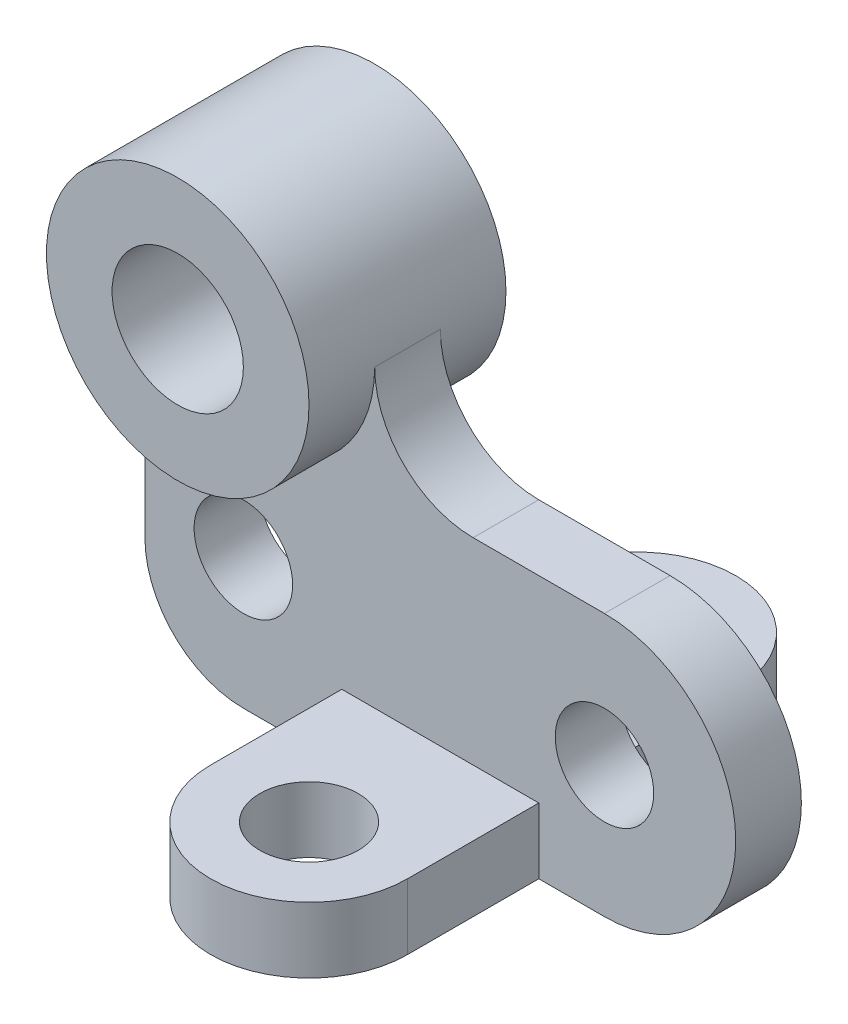
ISO-10303-21;
HEADER;
FILE_DESCRIPTION(('STEP AP214'),'2;1');
FILE_NAME('part.step','',(''),(''),'','','');
FILE_SCHEMA(('AUTOMOTIVE_DESIGN { 1 0 10303 214 1 1 1 1 }'));
ENDSEC;
DATA;
#1=APPLICATION_CONTEXT('core data for automotive mechanical design processes');
#2=APPLICATION_PROTOCOL_DEFINITION('international standard','automotive_design',2000,#1);
#3=PRODUCT_CONTEXT('',#1,'mechanical');
#4=PRODUCT('Part','Part','',(#3));
#5=PRODUCT_RELATED_PRODUCT_CATEGORY('part','',(#4));
#6=PRODUCT_DEFINITION_FORMATION('','',#4);
#7=PRODUCT_DEFINITION_CONTEXT('part definition',#1,'design');
#8=PRODUCT_DEFINITION('design','',#6,#7);
#9=PRODUCT_DEFINITION_SHAPE('','',#8);
#10=(LENGTH_UNIT() NAMED_UNIT(*) SI_UNIT(.MILLI.,.METRE.));
#11=(NAMED_UNIT(*) PLANE_ANGLE_UNIT() SI_UNIT($,.RADIAN.));
#12=(NAMED_UNIT(*) SI_UNIT($,.STERADIAN.) SOLID_ANGLE_UNIT());
#13=UNCERTAINTY_MEASURE_WITH_UNIT(LENGTH_MEASURE(1.E-05),#10,'distance_accuracy_value','');
#14=(GEOMETRIC_REPRESENTATION_CONTEXT(3) GLOBAL_UNCERTAINTY_ASSIGNED_CONTEXT((#13)) GLOBAL_UNIT_ASSIGNED_CONTEXT((#10,
#11,#12)) REPRESENTATION_CONTEXT('',''));
#15=CARTESIAN_POINT('',(0.,0.,0.));
#16=DIRECTION('',(0.,0.,1.));
#17=DIRECTION('',(1.,0.,0.));
#18=AXIS2_PLACEMENT_3D('',#15,#16,#17);
#19=CARTESIAN_POINT('',(-19.05,0.,6.35));
#20=DIRECTION('',(1.,0.,0.));
#21=DIRECTION('',(0.,1.,0.));
#22=AXIS2_PLACEMENT_3D('',#19,#20,#21);
#23=PLANE('',#22);
#24=DIRECTION('',(0.,-1.,0.));
#25=VECTOR('',#24,1.);
#26=CARTESIAN_POINT('',(-19.05,0.,-6.35));
#27=LINE('',#26,#25);
#28=CARTESIAN_POINT('',(-19.05,-16.8005208252601,-6.35));
#29=VERTEX_POINT('',#28);
#30=CARTESIAN_POINT('',(-19.05,-50.7999999999999,-6.35));
#31=VERTEX_POINT('',#30);
#32=EDGE_CURVE('E283',#29,#31,#27,.T.);
#33=ORIENTED_EDGE('',*,*,#32,.T.);
#34=DIRECTION('',(0.,0.,-1.));
#35=VECTOR('',#34,1.);
#36=CARTESIAN_POINT('',(-19.05,-50.7999999999999,6.35));
#37=LINE('',#36,#35);
#38=CARTESIAN_POINT('',(-19.05,-50.7999999999999,6.35));
#39=VERTEX_POINT('',#38);
#40=EDGE_CURVE('E330',#39,#31,#37,.T.);
#41=ORIENTED_EDGE('',*,*,#40,.F.);
#42=DIRECTION('',(0.,-1.,0.));
#43=VECTOR('',#42,1.);
#44=CARTESIAN_POINT('',(-19.05,0.,6.35));
#45=LINE('',#44,#43);
#46=CARTESIAN_POINT('',(-19.05,-16.8005208252601,6.35));
#47=VERTEX_POINT('',#46);
#48=EDGE_CURVE('E249',#47,#39,#45,.T.);
#49=ORIENTED_EDGE('',*,*,#48,.F.);
#50=DIRECTION('',(0.,0.,-1.));
#51=VECTOR('',#50,1.);
#52=CARTESIAN_POINT('',(-19.05,-16.8005208252601,6.35));
#53=LINE('',#52,#51);
#54=EDGE_CURVE('E275',#47,#29,#53,.T.);
#55=ORIENTED_EDGE('',*,*,#54,.T.);
#56=EDGE_LOOP('',(#33,#41,#49,#55));
#57=FACE_BOUND('',#56,.T.);
#58=ADVANCED_FACE('F41',(#57),#23,.F.);
#59=CARTESIAN_POINT('',(0.,-50.8,6.35));
#60=DIRECTION('',(0.,0.,-1.));
#61=DIRECTION('',(-1.,0.,0.));
#62=AXIS2_PLACEMENT_3D('',#59,#60,#61);
#63=CYLINDRICAL_SURFACE('',#62,19.05);
#64=CARTESIAN_POINT('',(0.,-50.8,-6.35));
#65=DIRECTION('',(0.,0.,1.));
#66=DIRECTION('',(1.,0.,0.));
#67=AXIS2_PLACEMENT_3D('',#64,#65,#66);
#68=CIRCLE('',#67,19.05);
#69=CARTESIAN_POINT('',(1.35308431126191E-13,-69.85,-6.35));
#70=VERTEX_POINT('',#69);
#71=EDGE_CURVE('E287',#31,#70,#68,.T.);
#72=ORIENTED_EDGE('',*,*,#71,.T.);
#73=DIRECTION('',(0.,0.,-1.));
#74=VECTOR('',#73,1.);
#75=CARTESIAN_POINT('',(1.35308431126191E-13,-69.85,6.35));
#76=LINE('',#75,#74);
#77=CARTESIAN_POINT('',(1.35308431126191E-13,-69.85,6.35));
#78=VERTEX_POINT('',#77);
#79=EDGE_CURVE('E326',#78,#70,#76,.T.);
#80=ORIENTED_EDGE('',*,*,#79,.F.);
#81=CARTESIAN_POINT('',(0.,-50.8,6.35));
#82=DIRECTION('',(0.,0.,1.));
#83=DIRECTION('',(1.,0.,0.));
#84=AXIS2_PLACEMENT_3D('',#81,#82,#83);
#85=CIRCLE('',#84,19.05);
#86=EDGE_CURVE('E253',#39,#78,#85,.T.);
#87=ORIENTED_EDGE('',*,*,#86,.F.);
#88=ORIENTED_EDGE('',*,*,#40,.T.);
#89=EDGE_LOOP('',(#72,#80,#87,#88));
#90=FACE_BOUND('',#89,.T.);
#91=ADVANCED_FACE('F352',(#90),#63,.T.);
#92=CARTESIAN_POINT('',(0.,-69.85,6.35));
#93=DIRECTION('',(0.,1.,0.));
#94=DIRECTION('',(0.,0.,1.));
#95=AXIS2_PLACEMENT_3D('',#92,#93,#94);
#96=PLANE('',#95);
#97=DIRECTION('',(1.,0.,0.));
#98=VECTOR('',#97,1.);
#99=CARTESIAN_POINT('',(0.,-69.85,6.35));
#100=LINE('',#99,#98);
#101=CARTESIAN_POINT('',(57.15,-69.85,6.35));
#102=VERTEX_POINT('',#101);
#103=CARTESIAN_POINT('',(69.85,-69.85,6.35));
#104=VERTEX_POINT('',#103);
#105=EDGE_CURVE('E256',#102,#104,#100,.T.);
#106=ORIENTED_EDGE('',*,*,#105,.F.);
#107=DIRECTION('',(0.,0.,1.));
#108=VECTOR('',#107,1.);
#109=CARTESIAN_POINT('',(57.15,-69.85,-31.75));
#110=LINE('',#109,#108);
#111=CARTESIAN_POINT('',(57.15,-69.85,31.75));
#112=VERTEX_POINT('',#111);
#113=EDGE_CURVE('E200',#102,#112,#110,.T.);
#114=ORIENTED_EDGE('',*,*,#113,.T.);
#115=CARTESIAN_POINT('',(38.1,-69.85,31.75));
#116=DIRECTION('',(0.,-1.,0.));
#117=DIRECTION('',(0.,0.,-1.));
#118=AXIS2_PLACEMENT_3D('',#115,#116,#117);
#119=CIRCLE('',#118,19.05);
#120=CARTESIAN_POINT('',(19.05,-69.85,31.75));
#121=VERTEX_POINT('',#120);
#122=EDGE_CURVE('E204',#112,#121,#119,.T.);
#123=ORIENTED_EDGE('',*,*,#122,.T.);
#124=DIRECTION('',(0.,0.,-1.));
#125=VECTOR('',#124,1.);
#126=CARTESIAN_POINT('',(19.05,-69.85,-31.75));
#127=LINE('',#126,#125);
#128=CARTESIAN_POINT('',(19.05,-69.85,6.35));
#129=VERTEX_POINT('',#128);
#130=EDGE_CURVE('E179',#121,#129,#127,.T.);
#131=ORIENTED_EDGE('',*,*,#130,.T.);
#132=EDGE_CURVE('E257',#78,#129,#100,.T.);
#133=ORIENTED_EDGE('',*,*,#132,.F.);
#134=ORIENTED_EDGE('',*,*,#79,.T.);
#135=DIRECTION('',(1.,0.,0.));
#136=VECTOR('',#135,1.);
#137=CARTESIAN_POINT('',(0.,-69.85,-6.35));
#138=LINE('',#137,#136);
#139=CARTESIAN_POINT('',(19.05,-69.85,-6.35));
#140=VERTEX_POINT('',#139);
#141=EDGE_CURVE('E291',#70,#140,#138,.T.);
#142=ORIENTED_EDGE('',*,*,#141,.T.);
#143=CARTESIAN_POINT('',(19.05,-69.85,-31.75));
#144=VERTEX_POINT('',#143);
#145=EDGE_CURVE('E184',#140,#144,#127,.T.);
#146=ORIENTED_EDGE('',*,*,#145,.T.);
#147=CARTESIAN_POINT('',(38.1,-69.85,-31.75));
#148=DIRECTION('',(0.,-1.,0.));
#149=DIRECTION('',(0.,0.,-1.));
#150=AXIS2_PLACEMENT_3D('',#147,#148,#149);
#151=CIRCLE('',#150,19.05);
#152=CARTESIAN_POINT('',(57.15,-69.85,-31.75));
#153=VERTEX_POINT('',#152);
#154=EDGE_CURVE('E197',#144,#153,#151,.T.);
#155=ORIENTED_EDGE('',*,*,#154,.T.);
#156=CARTESIAN_POINT('',(57.15,-69.85,-6.35));
#157=VERTEX_POINT('',#156);
#158=EDGE_CURVE('E154',#153,#157,#110,.T.);
#159=ORIENTED_EDGE('',*,*,#158,.T.);
#160=CARTESIAN_POINT('',(69.85,-69.85,-6.35));
#161=VERTEX_POINT('',#160);
#162=EDGE_CURVE('E290',#157,#161,#138,.T.);
#163=ORIENTED_EDGE('',*,*,#162,.T.);
#164=DIRECTION('',(0.,0.,-1.));
#165=VECTOR('',#164,1.);
#166=CARTESIAN_POINT('',(69.85,-69.85,6.35));
#167=LINE('',#166,#165);
#168=EDGE_CURVE('E322',#104,#161,#167,.T.);
#169=ORIENTED_EDGE('',*,*,#168,.F.);
#170=EDGE_LOOP('',(#106,#114,#123,#131,#133,#134,#142,#146,#155,#159,#163,#169));
#171=FACE_BOUND('',#170,.T.);
#172=CARTESIAN_POINT('',(38.1,-69.85,-31.75));
#173=DIRECTION('',(0.,-1.,0.));
#174=DIRECTION('',(0.,0.,-1.));
#175=AXIS2_PLACEMENT_3D('',#172,#173,#174);
#176=CIRCLE('',#175,9.525);
#177=CARTESIAN_POINT('',(38.1,-69.85,-41.275));
#178=VERTEX_POINT('',#177);
#179=EDGE_CURVE('E391',#178,#178,#176,.T.);
#180=ORIENTED_EDGE('',*,*,#179,.F.);
#181=EDGE_LOOP('',(#180));
#182=FACE_BOUND('',#181,.T.);
#183=CARTESIAN_POINT('',(38.1,-69.85,31.75));
#184=DIRECTION('',(0.,-1.,0.));
#185=DIRECTION('',(0.,0.,-1.));
#186=AXIS2_PLACEMENT_3D('',#183,#184,#185);
#187=CIRCLE('',#186,9.525);
#188=CARTESIAN_POINT('',(38.1,-69.85,22.225));
#189=VERTEX_POINT('',#188);
#190=EDGE_CURVE('E187',#189,#189,#187,.T.);
#191=ORIENTED_EDGE('',*,*,#190,.F.);
#192=EDGE_LOOP('',(#191));
#193=FACE_BOUND('',#192,.T.);
#194=ADVANCED_FACE('F347',(#171,#182,#193),#96,.F.);
#195=CARTESIAN_POINT('',(69.85,-44.45,6.35));
#196=DIRECTION('',(0.,0.,-1.));
#197=DIRECTION('',(-1.,0.,0.));
#198=AXIS2_PLACEMENT_3D('',#195,#196,#197);
#199=CYLINDRICAL_SURFACE('',#198,25.4);
#200=CARTESIAN_POINT('',(69.85,-44.45,-6.35));
#201=DIRECTION('',(0.,0.,1.));
#202=DIRECTION('',(1.,0.,0.));
#203=AXIS2_PLACEMENT_3D('',#200,#201,#202);
#204=CIRCLE('',#203,25.4);
#205=CARTESIAN_POINT('',(69.85,-19.05,-6.35));
#206=VERTEX_POINT('',#205);
#207=EDGE_CURVE('E295',#206,#161,#204,.F.);
#208=ORIENTED_EDGE('',*,*,#207,.F.);
#209=DIRECTION('',(0.,0.,-1.));
#210=VECTOR('',#209,1.);
#211=CARTESIAN_POINT('',(69.85,-19.05,6.35));
#212=LINE('',#211,#210);
#213=CARTESIAN_POINT('',(69.85,-19.05,6.35));
#214=VERTEX_POINT('',#213);
#215=EDGE_CURVE('E319',#214,#206,#212,.T.);
#216=ORIENTED_EDGE('',*,*,#215,.F.);
#217=CARTESIAN_POINT('',(69.85,-44.45,6.35));
#218=DIRECTION('',(0.,0.,1.));
#219=DIRECTION('',(1.,0.,0.));
#220=AXIS2_PLACEMENT_3D('',#217,#218,#219);
#221=CIRCLE('',#220,25.4);
#222=EDGE_CURVE('E260',#214,#104,#221,.F.);
#223=ORIENTED_EDGE('',*,*,#222,.T.);
#224=ORIENTED_EDGE('',*,*,#168,.T.);
#225=EDGE_LOOP('',(#208,#216,#223,#224));
#226=FACE_BOUND('',#225,.T.);
#227=ADVANCED_FACE('F372',(#226),#199,.T.);
#228=CARTESIAN_POINT('',(0.,-19.05,6.35));
#229=DIRECTION('',(0.,1.,0.));
#230=DIRECTION('',(0.,0.,1.));
#231=AXIS2_PLACEMENT_3D('',#228,#229,#230);
#232=PLANE('',#231);
#233=DIRECTION('',(1.,0.,0.));
#234=VECTOR('',#233,1.);
#235=CARTESIAN_POINT('',(0.,-19.05,-6.35));
#236=LINE('',#235,#234);
#237=CARTESIAN_POINT('',(44.45,-19.05,-6.35));
#238=VERTEX_POINT('',#237);
#239=EDGE_CURVE('E299',#238,#206,#236,.T.);
#240=ORIENTED_EDGE('',*,*,#239,.F.);
#241=DIRECTION('',(0.,0.,-1.));
#242=VECTOR('',#241,1.);
#243=CARTESIAN_POINT('',(44.45,-19.05,6.35));
#244=LINE('',#243,#242);
#245=CARTESIAN_POINT('',(44.45,-19.05,6.35));
#246=VERTEX_POINT('',#245);
#247=EDGE_CURVE('E316',#246,#238,#244,.T.);
#248=ORIENTED_EDGE('',*,*,#247,.F.);
#249=DIRECTION('',(1.,0.,0.));
#250=VECTOR('',#249,1.);
#251=CARTESIAN_POINT('',(0.,-19.05,6.35));
#252=LINE('',#251,#250);
#253=EDGE_CURVE('E264',#246,#214,#252,.T.);
#254=ORIENTED_EDGE('',*,*,#253,.T.);
#255=ORIENTED_EDGE('',*,*,#215,.T.);
#256=EDGE_LOOP('',(#240,#248,#254,#255));
#257=FACE_BOUND('',#256,.T.);
#258=ADVANCED_FACE('F368',(#257),#232,.T.);
#259=CARTESIAN_POINT('',(44.45,0.,6.35));
#260=DIRECTION('',(0.,0.,-1.));
#261=DIRECTION('',(-1.,0.,0.));
#262=AXIS2_PLACEMENT_3D('',#259,#260,#261);
#263=CYLINDRICAL_SURFACE('',#262,19.05);
#264=CARTESIAN_POINT('',(44.45,0.,-6.35));
#265=DIRECTION('',(0.,0.,1.));
#266=DIRECTION('',(1.,0.,0.));
#267=AXIS2_PLACEMENT_3D('',#264,#265,#266);
#268=CIRCLE('',#267,19.05);
#269=CARTESIAN_POINT('',(25.4,0.,-6.35));
#270=VERTEX_POINT('',#269);
#271=EDGE_CURVE('E303',#238,#270,#268,.F.);
#272=ORIENTED_EDGE('',*,*,#271,.T.);
#273=DIRECTION('',(0.,0.,-1.));
#274=VECTOR('',#273,1.);
#275=CARTESIAN_POINT('',(25.4,0.,6.35));
#276=LINE('',#275,#274);
#277=CARTESIAN_POINT('',(25.4,0.,6.35));
#278=VERTEX_POINT('',#277);
#279=EDGE_CURVE('E313',#278,#270,#276,.T.);
#280=ORIENTED_EDGE('',*,*,#279,.F.);
#281=CARTESIAN_POINT('',(44.45,0.,6.35));
#282=DIRECTION('',(0.,0.,1.));
#283=DIRECTION('',(1.,0.,0.));
#284=AXIS2_PLACEMENT_3D('',#281,#282,#283);
#285=CIRCLE('',#284,19.05);
#286=EDGE_CURVE('E268',#246,#278,#285,.F.);
#287=ORIENTED_EDGE('',*,*,#286,.F.);
#288=ORIENTED_EDGE('',*,*,#247,.T.);
#289=EDGE_LOOP('',(#272,#280,#287,#288));
#290=FACE_BOUND('',#289,.T.);
#291=ADVANCED_FACE('F365',(#290),#263,.F.);
#292=CARTESIAN_POINT('',(69.85,-44.45,6.35));
#293=DIRECTION('',(0.,0.,-1.));
#294=DIRECTION('',(-1.,0.,0.));
#295=AXIS2_PLACEMENT_3D('',#292,#293,#294);
#296=CYLINDRICAL_SURFACE('',#295,9.52499999999999);
#297=CARTESIAN_POINT('',(69.85,-44.45,6.35));
#298=DIRECTION('',(0.,0.,1.));
#299=DIRECTION('',(1.,0.,0.));
#300=AXIS2_PLACEMENT_3D('',#297,#298,#299);
#301=CIRCLE('',#300,9.52499999999999);
#302=CARTESIAN_POINT('',(79.375,-44.45,6.35));
#303=VERTEX_POINT('',#302);
#304=EDGE_CURVE('E244',#303,#303,#301,.T.);
#305=ORIENTED_EDGE('',*,*,#304,.T.);
#306=EDGE_LOOP('',(#305));
#307=FACE_BOUND('',#306,.T.);
#308=CARTESIAN_POINT('',(69.85,-44.45,-6.35));
#309=DIRECTION('',(0.,0.,1.));
#310=DIRECTION('',(1.,0.,0.));
#311=AXIS2_PLACEMENT_3D('',#308,#309,#310);
#312=CIRCLE('',#311,9.52499999999999);
#313=CARTESIAN_POINT('',(79.375,-44.45,-6.35));
#314=VERTEX_POINT('',#313);
#315=EDGE_CURVE('E279',#314,#314,#312,.T.);
#316=ORIENTED_EDGE('',*,*,#315,.F.);
#317=EDGE_LOOP('',(#316));
#318=FACE_BOUND('',#317,.T.);
#319=ADVANCED_FACE('F421',(#307,#318),#296,.F.);
#320=CARTESIAN_POINT('',(0.,-44.45,6.35));
#321=DIRECTION('',(0.,0.,-1.));
#322=DIRECTION('',(-1.,0.,0.));
#323=AXIS2_PLACEMENT_3D('',#320,#321,#322);
#324=CYLINDRICAL_SURFACE('',#323,9.525);
#325=CARTESIAN_POINT('',(0.,-44.45,6.35));
#326=DIRECTION('',(0.,0.,1.));
#327=DIRECTION('',(1.,0.,0.));
#328=AXIS2_PLACEMENT_3D('',#325,#326,#327);
#329=CIRCLE('',#328,9.525);
#330=CARTESIAN_POINT('',(9.525,-44.45,6.35));
#331=VERTEX_POINT('',#330);
#332=EDGE_CURVE('E240',#331,#331,#329,.T.);
#333=ORIENTED_EDGE('',*,*,#332,.T.);
#334=EDGE_LOOP('',(#333));
#335=FACE_BOUND('',#334,.T.);
#336=CARTESIAN_POINT('',(0.,-44.45,-6.35));
#337=DIRECTION('',(0.,0.,1.));
#338=DIRECTION('',(1.,0.,0.));
#339=AXIS2_PLACEMENT_3D('',#336,#337,#338);
#340=CIRCLE('',#339,9.525);
#341=CARTESIAN_POINT('',(9.525,-44.45,-6.35));
#342=VERTEX_POINT('',#341);
#343=EDGE_CURVE('E233',#342,#342,#340,.T.);
#344=ORIENTED_EDGE('',*,*,#343,.F.);
#345=EDGE_LOOP('',(#344));
#346=FACE_BOUND('',#345,.T.);
#347=ADVANCED_FACE('F43',(#335,#346),#324,.F.);
#348=CARTESIAN_POINT('',(0.,0.,6.35));
#349=DIRECTION('',(0.,0.,1.));
#350=DIRECTION('',(1.,0.,0.));
#351=AXIS2_PLACEMENT_3D('',#348,#349,#350);
#352=PLANE('',#351);
#353=DIRECTION('',(0.,-1.,0.));
#354=VECTOR('',#353,1.);
#355=CARTESIAN_POINT('',(19.05,0.,6.35));
#356=LINE('',#355,#354);
#357=CARTESIAN_POINT('',(19.05,-57.15,6.35));
#358=VERTEX_POINT('',#357);
#359=EDGE_CURVE('E62',#358,#129,#356,.T.);
#360=ORIENTED_EDGE('',*,*,#359,.F.);
#361=DIRECTION('',(1.,0.,0.));
#362=VECTOR('',#361,1.);
#363=CARTESIAN_POINT('',(0.,-57.15,6.35));
#364=LINE('',#363,#362);
#365=CARTESIAN_POINT('',(57.15,-57.15,6.35));
#366=VERTEX_POINT('',#365);
#367=EDGE_CURVE('E57',#358,#366,#364,.T.);
#368=ORIENTED_EDGE('',*,*,#367,.T.);
#369=DIRECTION('',(0.,1.,0.));
#370=VECTOR('',#369,1.);
#371=CARTESIAN_POINT('',(57.15,0.,6.35));
#372=LINE('',#371,#370);
#373=EDGE_CURVE('E218',#102,#366,#372,.T.);
#374=ORIENTED_EDGE('',*,*,#373,.F.);
#375=ORIENTED_EDGE('',*,*,#105,.T.);
#376=ORIENTED_EDGE('',*,*,#222,.F.);
#377=ORIENTED_EDGE('',*,*,#253,.F.);
#378=ORIENTED_EDGE('',*,*,#286,.T.);
#379=CARTESIAN_POINT('',(0.,0.,6.35));
#380=DIRECTION('',(0.,0.,1.));
#381=DIRECTION('',(1.,0.,0.));
#382=AXIS2_PLACEMENT_3D('',#379,#380,#381);
#383=CIRCLE('',#382,25.4);
#384=EDGE_CURVE('E272',#47,#278,#383,.T.);
#385=ORIENTED_EDGE('',*,*,#384,.F.);
#386=ORIENTED_EDGE('',*,*,#48,.T.);
#387=ORIENTED_EDGE('',*,*,#86,.T.);
#388=ORIENTED_EDGE('',*,*,#132,.T.);
#389=EDGE_LOOP('',(#360,#368,#374,#375,#376,#377,#378,#385,#386,#387,#388));
#390=FACE_BOUND('',#389,.T.);
#391=ORIENTED_EDGE('',*,*,#332,.F.);
#392=EDGE_LOOP('',(#391));
#393=FACE_BOUND('',#392,.T.);
#394=ORIENTED_EDGE('',*,*,#304,.F.);
#395=EDGE_LOOP('',(#394));
#396=FACE_BOUND('',#395,.T.);
#397=ADVANCED_FACE('F375',(#390,#393,#396),#352,.T.);
#398=CARTESIAN_POINT('',(0.,0.,-6.35));
#399=DIRECTION('',(0.,0.,1.));
#400=DIRECTION('',(1.,0.,0.));
#401=AXIS2_PLACEMENT_3D('',#398,#399,#400);
#402=PLANE('',#401);
#403=ORIENTED_EDGE('',*,*,#343,.T.);
#404=EDGE_LOOP('',(#403));
#405=FACE_BOUND('',#404,.T.);
#406=ORIENTED_EDGE('',*,*,#315,.T.);
#407=EDGE_LOOP('',(#406));
#408=FACE_BOUND('',#407,.T.);
#409=DIRECTION('',(1.,0.,0.));
#410=VECTOR('',#409,1.);
#411=CARTESIAN_POINT('',(0.,-57.15,-6.35));
#412=LINE('',#411,#410);
#413=CARTESIAN_POINT('',(19.05,-57.15,-6.35));
#414=VERTEX_POINT('',#413);
#415=CARTESIAN_POINT('',(57.15,-57.15,-6.35));
#416=VERTEX_POINT('',#415);
#417=EDGE_CURVE('E169',#414,#416,#412,.T.);
#418=ORIENTED_EDGE('',*,*,#417,.F.);
#419=DIRECTION('',(0.,-1.,0.));
#420=VECTOR('',#419,1.);
#421=CARTESIAN_POINT('',(19.05,0.,-6.35));
#422=LINE('',#421,#420);
#423=EDGE_CURVE('E11',#414,#140,#422,.T.);
#424=ORIENTED_EDGE('',*,*,#423,.T.);
#425=ORIENTED_EDGE('',*,*,#141,.F.);
#426=ORIENTED_EDGE('',*,*,#71,.F.);
#427=ORIENTED_EDGE('',*,*,#32,.F.);
#428=CARTESIAN_POINT('',(0.,0.,-6.35));
#429=DIRECTION('',(0.,0.,1.));
#430=DIRECTION('',(1.,0.,0.));
#431=AXIS2_PLACEMENT_3D('',#428,#429,#430);
#432=CIRCLE('',#431,25.4);
#433=EDGE_CURVE('E245',#29,#270,#432,.T.);
#434=ORIENTED_EDGE('',*,*,#433,.T.);
#435=ORIENTED_EDGE('',*,*,#271,.F.);
#436=ORIENTED_EDGE('',*,*,#239,.T.);
#437=ORIENTED_EDGE('',*,*,#207,.T.);
#438=ORIENTED_EDGE('',*,*,#162,.F.);
#439=DIRECTION('',(0.,1.,0.));
#440=VECTOR('',#439,1.);
#441=CARTESIAN_POINT('',(57.15,0.,-6.35));
#442=LINE('',#441,#440);
#443=EDGE_CURVE('E50',#157,#416,#442,.T.);
#444=ORIENTED_EDGE('',*,*,#443,.T.);
#445=EDGE_LOOP('',(#418,#424,#425,#426,#427,#434,#435,#436,#437,#438,#444));
#446=FACE_BOUND('',#445,.T.);
#447=ADVANCED_FACE('F338',(#405,#408,#446),#402,.F.);
#448=CARTESIAN_POINT('',(0.,0.,19.05));
#449=DIRECTION('',(0.,0.,-1.));
#450=DIRECTION('',(-1.,0.,0.));
#451=AXIS2_PLACEMENT_3D('',#448,#449,#450);
#452=CYLINDRICAL_SURFACE('',#451,12.7);
#453=CARTESIAN_POINT('',(0.,0.,19.05));
#454=DIRECTION('',(0.,0.,1.));
#455=DIRECTION('',(1.,0.,0.));
#456=AXIS2_PLACEMENT_3D('',#453,#454,#455);
#457=CIRCLE('',#456,12.7);
#458=CARTESIAN_POINT('',(12.7,0.,19.05));
#459=VERTEX_POINT('',#458);
#460=EDGE_CURVE('E224',#459,#459,#457,.T.);
#461=ORIENTED_EDGE('',*,*,#460,.T.);
#462=EDGE_LOOP('',(#461));
#463=FACE_BOUND('',#462,.T.);
#464=CARTESIAN_POINT('',(0.,0.,-19.05));
#465=DIRECTION('',(0.,0.,1.));
#466=DIRECTION('',(1.,0.,0.));
#467=AXIS2_PLACEMENT_3D('',#464,#465,#466);
#468=CIRCLE('',#467,12.7);
#469=CARTESIAN_POINT('',(12.7,0.,-19.05));
#470=VERTEX_POINT('',#469);
#471=EDGE_CURVE('E223',#470,#470,#468,.T.);
#472=ORIENTED_EDGE('',*,*,#471,.F.);
#473=EDGE_LOOP('',(#472));
#474=FACE_BOUND('',#473,.T.);
#475=ADVANCED_FACE('F435',(#463,#474),#452,.F.);
#476=CARTESIAN_POINT('',(0.,0.,19.05));
#477=DIRECTION('',(0.,0.,-1.));
#478=DIRECTION('',(-1.,0.,0.));
#479=AXIS2_PLACEMENT_3D('',#476,#477,#478);
#480=CYLINDRICAL_SURFACE('',#479,25.4);
#481=ORIENTED_EDGE('',*,*,#384,.T.);
#482=ORIENTED_EDGE('',*,*,#279,.T.);
#483=ORIENTED_EDGE('',*,*,#433,.F.);
#484=ORIENTED_EDGE('',*,*,#54,.F.);
#485=EDGE_LOOP('',(#481,#482,#483,#484));
#486=FACE_BOUND('',#485,.T.);
#487=CARTESIAN_POINT('',(0.,0.,19.05));
#488=DIRECTION('',(0.,0.,1.));
#489=DIRECTION('',(1.,0.,0.));
#490=AXIS2_PLACEMENT_3D('',#487,#488,#489);
#491=CIRCLE('',#490,25.4);
#492=CARTESIAN_POINT('',(25.4,0.,19.05));
#493=VERTEX_POINT('',#492);
#494=EDGE_CURVE('E228',#493,#493,#491,.T.);
#495=ORIENTED_EDGE('',*,*,#494,.F.);
#496=EDGE_LOOP('',(#495));
#497=FACE_BOUND('',#496,.T.);
#498=CARTESIAN_POINT('',(0.,0.,-19.05));
#499=DIRECTION('',(0.,0.,1.));
#500=DIRECTION('',(1.,0.,0.));
#501=AXIS2_PLACEMENT_3D('',#498,#499,#500);
#502=CIRCLE('',#501,25.4);
#503=CARTESIAN_POINT('',(25.4,0.,-19.05));
#504=VERTEX_POINT('',#503);
#505=EDGE_CURVE('E229',#504,#504,#502,.T.);
#506=ORIENTED_EDGE('',*,*,#505,.T.);
#507=EDGE_LOOP('',(#506));
#508=FACE_BOUND('',#507,.T.);
#509=ADVANCED_FACE('F360',(#486,#497,#508),#480,.T.);
#510=CARTESIAN_POINT('',(0.,0.,19.05));
#511=DIRECTION('',(0.,0.,1.));
#512=DIRECTION('',(1.,0.,0.));
#513=AXIS2_PLACEMENT_3D('',#510,#511,#512);
#514=PLANE('',#513);
#515=ORIENTED_EDGE('',*,*,#460,.F.);
#516=EDGE_LOOP('',(#515));
#517=FACE_BOUND('',#516,.T.);
#518=ORIENTED_EDGE('',*,*,#494,.T.);
#519=EDGE_LOOP('',(#518));
#520=FACE_BOUND('',#519,.T.);
#521=ADVANCED_FACE('F482',(#517,#520),#514,.T.);
#522=CARTESIAN_POINT('',(0.,0.,-19.05));
#523=DIRECTION('',(0.,0.,1.));
#524=DIRECTION('',(1.,0.,0.));
#525=AXIS2_PLACEMENT_3D('',#522,#523,#524);
#526=PLANE('',#525);
#527=ORIENTED_EDGE('',*,*,#471,.T.);
#528=EDGE_LOOP('',(#527));
#529=FACE_BOUND('',#528,.T.);
#530=ORIENTED_EDGE('',*,*,#505,.F.);
#531=EDGE_LOOP('',(#530));
#532=FACE_BOUND('',#531,.T.);
#533=ADVANCED_FACE('F491',(#529,#532),#526,.F.);
#534=CARTESIAN_POINT('',(38.1,-57.15,-31.75));
#535=DIRECTION('',(0.,-1.,0.));
#536=DIRECTION('',(0.,0.,-1.));
#537=AXIS2_PLACEMENT_3D('',#534,#535,#536);
#538=CYLINDRICAL_SURFACE('',#537,19.05);
#539=ORIENTED_EDGE('',*,*,#154,.F.);
#540=DIRECTION('',(0.,-1.,0.));
#541=VECTOR('',#540,1.);
#542=CARTESIAN_POINT('',(19.05,-57.15,-31.75));
#543=LINE('',#542,#541);
#544=CARTESIAN_POINT('',(19.05,-57.15,-31.75));
#545=VERTEX_POINT('',#544);
#546=EDGE_CURVE('E177',#545,#144,#543,.T.);
#547=ORIENTED_EDGE('',*,*,#546,.F.);
#548=CARTESIAN_POINT('',(38.1,-57.15,-31.75));
#549=DIRECTION('',(0.,-1.,0.));
#550=DIRECTION('',(0.,0.,-1.));
#551=AXIS2_PLACEMENT_3D('',#548,#549,#550);
#552=CIRCLE('',#551,19.05);
#553=CARTESIAN_POINT('',(57.15,-57.15,-31.75));
#554=VERTEX_POINT('',#553);
#555=EDGE_CURVE('E167',#545,#554,#552,.T.);
#556=ORIENTED_EDGE('',*,*,#555,.T.);
#557=DIRECTION('',(0.,-1.,0.));
#558=VECTOR('',#557,1.);
#559=CARTESIAN_POINT('',(57.15,-57.15,-31.75));
#560=LINE('',#559,#558);
#561=EDGE_CURVE('E148',#554,#153,#560,.T.);
#562=ORIENTED_EDGE('',*,*,#561,.T.);
#563=EDGE_LOOP('',(#539,#547,#556,#562));
#564=FACE_BOUND('',#563,.T.);
#565=ADVANCED_FACE('F175',(#564),#538,.T.);
#566=CARTESIAN_POINT('',(38.1,-57.15,-31.75));
#567=DIRECTION('',(0.,-1.,0.));
#568=DIRECTION('',(0.,0.,-1.));
#569=AXIS2_PLACEMENT_3D('',#566,#567,#568);
#570=CYLINDRICAL_SURFACE('',#569,9.525);
#571=CARTESIAN_POINT('',(38.1,-57.15,-31.75));
#572=DIRECTION('',(0.,-1.,0.));
#573=DIRECTION('',(0.,0.,-1.));
#574=AXIS2_PLACEMENT_3D('',#571,#572,#573);
#575=CIRCLE('',#574,9.525);
#576=CARTESIAN_POINT('',(38.1,-57.15,-41.275));
#577=VERTEX_POINT('',#576);
#578=EDGE_CURVE('E388',#577,#577,#575,.T.);
#579=ORIENTED_EDGE('',*,*,#578,.F.);
#580=EDGE_LOOP('',(#579));
#581=FACE_BOUND('',#580,.T.);
#582=ORIENTED_EDGE('',*,*,#179,.T.);
#583=EDGE_LOOP('',(#582));
#584=FACE_BOUND('',#583,.T.);
#585=ADVANCED_FACE('F397',(#581,#584),#570,.F.);
#586=CARTESIAN_POINT('',(38.1,-57.15,-31.75));
#587=DIRECTION('',(0.,-1.,0.));
#588=DIRECTION('',(0.,0.,-1.));
#589=AXIS2_PLACEMENT_3D('',#586,#587,#588);
#590=PLANE('',#589);
#591=ORIENTED_EDGE('',*,*,#578,.T.);
#592=EDGE_LOOP('',(#591));
#593=FACE_BOUND('',#592,.T.);
#594=DIRECTION('',(0.,0.,-1.));
#595=VECTOR('',#594,1.);
#596=CARTESIAN_POINT('',(19.05,-57.15,-31.75));
#597=LINE('',#596,#595);
#598=EDGE_CURVE('E193',#414,#545,#597,.T.);
#599=ORIENTED_EDGE('',*,*,#598,.F.);
#600=ORIENTED_EDGE('',*,*,#417,.T.);
#601=DIRECTION('',(0.,0.,1.));
#602=VECTOR('',#601,1.);
#603=CARTESIAN_POINT('',(57.15,-57.15,-31.75));
#604=LINE('',#603,#602);
#605=EDGE_CURVE('E152',#554,#416,#604,.T.);
#606=ORIENTED_EDGE('',*,*,#605,.F.);
#607=ORIENTED_EDGE('',*,*,#555,.F.);
#608=EDGE_LOOP('',(#599,#600,#606,#607));
#609=FACE_BOUND('',#608,.T.);
#610=ADVANCED_FACE('F166',(#593,#609),#590,.F.);
#611=CARTESIAN_POINT('',(57.15,-57.15,-31.75));
#612=DIRECTION('',(1.,0.,0.));
#613=DIRECTION('',(0.,0.,-1.));
#614=AXIS2_PLACEMENT_3D('',#611,#612,#613);
#615=PLANE('',#614);
#616=ORIENTED_EDGE('',*,*,#443,.F.);
#617=ORIENTED_EDGE('',*,*,#158,.F.);
#618=ORIENTED_EDGE('',*,*,#561,.F.);
#619=ORIENTED_EDGE('',*,*,#605,.T.);
#620=EDGE_LOOP('',(#616,#617,#618,#619));
#621=FACE_BOUND('',#620,.T.);
#622=ADVANCED_FACE('F151',(#621),#615,.T.);
#623=CARTESIAN_POINT('',(19.05,-57.15,-31.75));
#624=DIRECTION('',(-1.,0.,0.));
#625=DIRECTION('',(0.,0.,1.));
#626=AXIS2_PLACEMENT_3D('',#623,#624,#625);
#627=PLANE('',#626);
#628=ORIENTED_EDGE('',*,*,#423,.F.);
#629=ORIENTED_EDGE('',*,*,#598,.T.);
#630=ORIENTED_EDGE('',*,*,#546,.T.);
#631=ORIENTED_EDGE('',*,*,#145,.F.);
#632=EDGE_LOOP('',(#628,#629,#630,#631));
#633=FACE_BOUND('',#632,.T.);
#634=ADVANCED_FACE('F345',(#633),#627,.T.);
#635=CARTESIAN_POINT('',(19.05,-57.15,31.75));
#636=VERTEX_POINT('',#635);
#637=EDGE_CURVE('E161',#636,#358,#597,.T.);
#638=ORIENTED_EDGE('',*,*,#637,.T.);
#639=ORIENTED_EDGE('',*,*,#359,.T.);
#640=ORIENTED_EDGE('',*,*,#130,.F.);
#641=DIRECTION('',(0.,-1.,0.));
#642=VECTOR('',#641,1.);
#643=CARTESIAN_POINT('',(19.05,-57.15,31.75));
#644=LINE('',#643,#642);
#645=EDGE_CURVE('E210',#636,#121,#644,.T.);
#646=ORIENTED_EDGE('',*,*,#645,.F.);
#647=EDGE_LOOP('',(#638,#639,#640,#646));
#648=FACE_BOUND('',#647,.T.);
#649=ADVANCED_FACE('F557',(#648),#627,.T.);
#650=CARTESIAN_POINT('',(38.1,-57.15,31.75));
#651=DIRECTION('',(0.,-1.,0.));
#652=DIRECTION('',(0.,0.,-1.));
#653=AXIS2_PLACEMENT_3D('',#650,#651,#652);
#654=CYLINDRICAL_SURFACE('',#653,19.05);
#655=ORIENTED_EDGE('',*,*,#122,.F.);
#656=DIRECTION('',(0.,-1.,0.));
#657=VECTOR('',#656,1.);
#658=CARTESIAN_POINT('',(57.15,-57.15,31.75));
#659=LINE('',#658,#657);
#660=CARTESIAN_POINT('',(57.15,-57.15,31.75));
#661=VERTEX_POINT('',#660);
#662=EDGE_CURVE('E160',#661,#112,#659,.T.);
#663=ORIENTED_EDGE('',*,*,#662,.F.);
#664=CARTESIAN_POINT('',(38.1,-57.15,31.75));
#665=DIRECTION('',(0.,-1.,0.));
#666=DIRECTION('',(0.,0.,-1.));
#667=AXIS2_PLACEMENT_3D('',#664,#665,#666);
#668=CIRCLE('',#667,19.05);
#669=EDGE_CURVE('E171',#661,#636,#668,.T.);
#670=ORIENTED_EDGE('',*,*,#669,.T.);
#671=ORIENTED_EDGE('',*,*,#645,.T.);
#672=EDGE_LOOP('',(#655,#663,#670,#671));
#673=FACE_BOUND('',#672,.T.);
#674=ADVANCED_FACE('F566',(#673),#654,.T.);
#675=ORIENTED_EDGE('',*,*,#113,.F.);
#676=ORIENTED_EDGE('',*,*,#373,.T.);
#677=EDGE_CURVE('E172',#366,#661,#604,.T.);
#678=ORIENTED_EDGE('',*,*,#677,.T.);
#679=ORIENTED_EDGE('',*,*,#662,.T.);
#680=EDGE_LOOP('',(#675,#676,#678,#679));
#681=FACE_BOUND('',#680,.T.);
#682=ADVANCED_FACE('F379',(#681),#615,.T.);
#683=ORIENTED_EDGE('',*,*,#367,.F.);
#684=ORIENTED_EDGE('',*,*,#637,.F.);
#685=ORIENTED_EDGE('',*,*,#669,.F.);
#686=ORIENTED_EDGE('',*,*,#677,.F.);
#687=EDGE_LOOP('',(#683,#684,#685,#686));
#688=FACE_BOUND('',#687,.T.);
#689=CARTESIAN_POINT('',(38.1,-57.15,31.75));
#690=DIRECTION('',(0.,-1.,0.));
#691=DIRECTION('',(0.,0.,-1.));
#692=AXIS2_PLACEMENT_3D('',#689,#690,#691);
#693=CIRCLE('',#692,9.525);
#694=CARTESIAN_POINT('',(38.1,-57.15,22.225));
#695=VERTEX_POINT('',#694);
#696=EDGE_CURVE('E201',#695,#695,#693,.T.);
#697=ORIENTED_EDGE('',*,*,#696,.T.);
#698=EDGE_LOOP('',(#697));
#699=FACE_BOUND('',#698,.T.);
#700=ADVANCED_FACE('F405',(#688,#699),#590,.F.);
#701=CARTESIAN_POINT('',(38.1,-57.15,31.75));
#702=DIRECTION('',(0.,-1.,0.));
#703=DIRECTION('',(0.,0.,-1.));
#704=AXIS2_PLACEMENT_3D('',#701,#702,#703);
#705=CYLINDRICAL_SURFACE('',#704,9.525);
#706=ORIENTED_EDGE('',*,*,#696,.F.);
#707=EDGE_LOOP('',(#706));
#708=FACE_BOUND('',#707,.T.);
#709=ORIENTED_EDGE('',*,*,#190,.T.);
#710=EDGE_LOOP('',(#709));
#711=FACE_BOUND('',#710,.T.);
#712=ADVANCED_FACE('F403',(#708,#711),#705,.F.);
#713=CLOSED_SHELL('',(#58,#91,#194,#227,#258,#291,#319,#347,#397,#447,#475,#509,#521,#533,#565,
#585,#610,#622,#634,#649,#674,#682,#700,#712));
#714=MANIFOLD_SOLID_BREP('B2',#713);
#715=ADVANCED_BREP_SHAPE_REPRESENTATION('',(#18,#714),#14);
#716=SHAPE_DEFINITION_REPRESENTATION(#9,#715);
ENDSEC;
END-ISO-10303-21;
